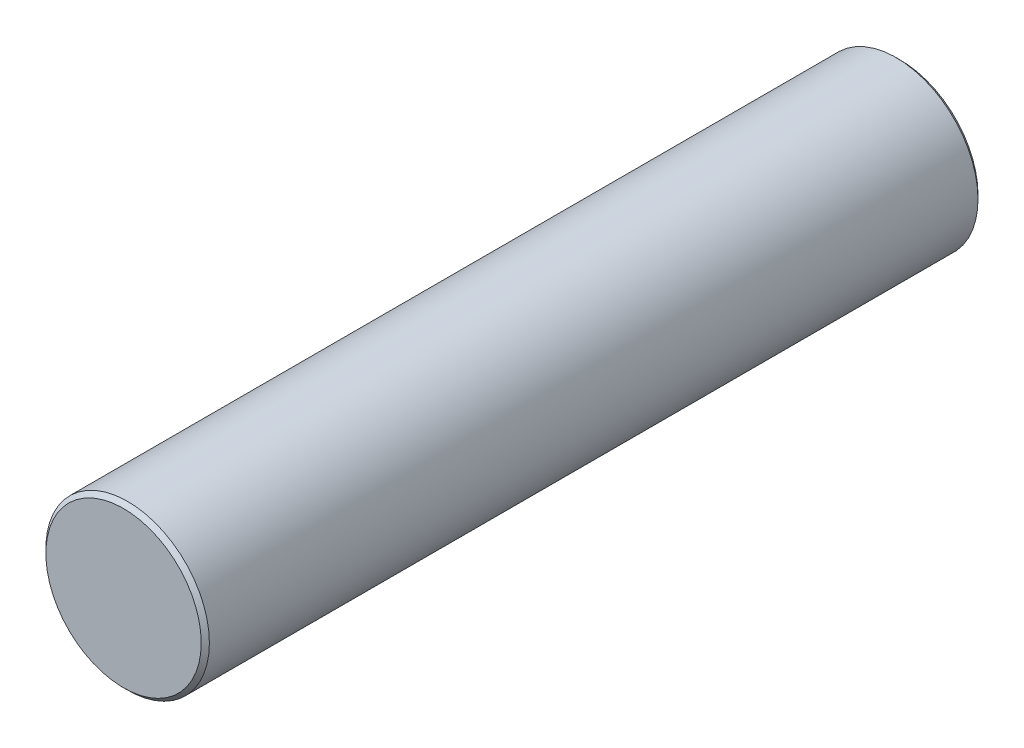
ISO-10303-21;
HEADER;
FILE_DESCRIPTION(('STEP AP214'),'2;1');
FILE_NAME('part.step','',(''),(''),'','','');
FILE_SCHEMA(('AUTOMOTIVE_DESIGN { 1 0 10303 214 1 1 1 1 }'));
ENDSEC;
DATA;
#1=APPLICATION_CONTEXT('core data for automotive mechanical design processes');
#2=APPLICATION_PROTOCOL_DEFINITION('international standard','automotive_design',2000,#1);
#3=PRODUCT_CONTEXT('',#1,'mechanical');
#4=PRODUCT('Part','Part','',(#3));
#5=PRODUCT_RELATED_PRODUCT_CATEGORY('part','',(#4));
#6=PRODUCT_DEFINITION_FORMATION('','',#4);
#7=PRODUCT_DEFINITION_CONTEXT('part definition',#1,'design');
#8=PRODUCT_DEFINITION('design','',#6,#7);
#9=PRODUCT_DEFINITION_SHAPE('','',#8);
#10=(LENGTH_UNIT() NAMED_UNIT(*) SI_UNIT(.MILLI.,.METRE.));
#11=(NAMED_UNIT(*) PLANE_ANGLE_UNIT() SI_UNIT($,.RADIAN.));
#12=(NAMED_UNIT(*) SI_UNIT($,.STERADIAN.) SOLID_ANGLE_UNIT());
#13=UNCERTAINTY_MEASURE_WITH_UNIT(LENGTH_MEASURE(1.E-05),#10,'distance_accuracy_value','');
#14=(GEOMETRIC_REPRESENTATION_CONTEXT(3) GLOBAL_UNCERTAINTY_ASSIGNED_CONTEXT((#13)) GLOBAL_UNIT_ASSIGNED_CONTEXT((#10,
#11,#12)) REPRESENTATION_CONTEXT('',''));
#15=CARTESIAN_POINT('',(0.,0.,0.));
#16=DIRECTION('',(0.,0.,1.));
#17=DIRECTION('',(1.,0.,0.));
#18=AXIS2_PLACEMENT_3D('',#15,#16,#17);
#19=CARTESIAN_POINT('',(0.,0.,190.));
#20=DIRECTION('',(0.,0.,-1.));
#21=DIRECTION('',(-1.,0.,0.));
#22=AXIS2_PLACEMENT_3D('',#19,#20,#21);
#23=CYLINDRICAL_SURFACE('',#22,20.);
#24=CARTESIAN_POINT('',(0.,0.,0.999999999999973));
#25=DIRECTION('',(0.,0.,1.));
#26=DIRECTION('',(1.,0.,0.));
#27=AXIS2_PLACEMENT_3D('',#24,#25,#26);
#28=CIRCLE('',#27,20.);
#29=CARTESIAN_POINT('',(20.,0.,0.999999999999973));
#30=VERTEX_POINT('',#29);
#31=EDGE_CURVE('E47',#30,#30,#28,.T.);
#32=ORIENTED_EDGE('',*,*,#31,.T.);
#33=EDGE_LOOP('',(#32));
#34=FACE_BOUND('',#33,.T.);
#35=CARTESIAN_POINT('',(0.,0.,189.));
#36=DIRECTION('',(0.,0.,1.));
#37=DIRECTION('',(1.,0.,0.));
#38=AXIS2_PLACEMENT_3D('',#35,#36,#37);
#39=CIRCLE('',#38,20.);
#40=CARTESIAN_POINT('',(20.,0.,189.));
#41=VERTEX_POINT('',#40);
#42=EDGE_CURVE('E51',#41,#41,#39,.F.);
#43=ORIENTED_EDGE('',*,*,#42,.T.);
#44=EDGE_LOOP('',(#43));
#45=FACE_BOUND('',#44,.T.);
#46=ADVANCED_FACE('F36',(#34,#45),#23,.T.);
#47=CARTESIAN_POINT('',(0.,0.,190.));
#48=DIRECTION('',(0.,0.,1.));
#49=DIRECTION('',(1.,0.,0.));
#50=AXIS2_PLACEMENT_3D('',#47,#48,#49);
#51=PLANE('',#50);
#52=CARTESIAN_POINT('',(0.,0.,190.));
#53=DIRECTION('',(0.,0.,1.));
#54=DIRECTION('',(1.,0.,0.));
#55=AXIS2_PLACEMENT_3D('',#52,#53,#54);
#56=CIRCLE('',#55,19.);
#57=CARTESIAN_POINT('',(19.,0.,190.));
#58=VERTEX_POINT('',#57);
#59=EDGE_CURVE('E10',#58,#58,#56,.T.);
#60=ORIENTED_EDGE('',*,*,#59,.T.);
#61=EDGE_LOOP('',(#60));
#62=FACE_BOUND('',#61,.T.);
#63=ADVANCED_FACE('F67',(#62),#51,.T.);
#64=CARTESIAN_POINT('',(0.,0.,0.));
#65=DIRECTION('',(0.,0.,1.));
#66=DIRECTION('',(1.,0.,0.));
#67=AXIS2_PLACEMENT_3D('',#64,#65,#66);
#68=PLANE('',#67);
#69=CARTESIAN_POINT('',(0.,0.,0.));
#70=DIRECTION('',(0.,0.,1.));
#71=DIRECTION('',(1.,0.,0.));
#72=AXIS2_PLACEMENT_3D('',#69,#70,#71);
#73=CIRCLE('',#72,19.);
#74=CARTESIAN_POINT('',(19.,0.,0.));
#75=VERTEX_POINT('',#74);
#76=EDGE_CURVE('E43',#75,#75,#73,.F.);
#77=ORIENTED_EDGE('',*,*,#76,.T.);
#78=EDGE_LOOP('',(#77));
#79=FACE_BOUND('',#78,.T.);
#80=ADVANCED_FACE('F64',(#79),#68,.F.);
#81=CARTESIAN_POINT('',(0.,0.,0.999999999999973));
#82=DIRECTION('',(0.,0.,1.));
#83=DIRECTION('',(1.,0.,0.));
#84=AXIS2_PLACEMENT_3D('',#81,#82,#83);
#85=CONICAL_SURFACE('',#84,20.,0.78539816339746);
#86=ORIENTED_EDGE('',*,*,#76,.F.);
#87=EDGE_LOOP('',(#86));
#88=FACE_BOUND('',#87,.T.);
#89=ORIENTED_EDGE('',*,*,#31,.F.);
#90=EDGE_LOOP('',(#89));
#91=FACE_BOUND('',#90,.T.);
#92=ADVANCED_FACE('F60',(#88,#91),#85,.T.);
#93=CARTESIAN_POINT('',(0.,0.,190.));
#94=DIRECTION('',(0.,0.,-1.));
#95=DIRECTION('',(-1.,0.,0.));
#96=AXIS2_PLACEMENT_3D('',#93,#94,#95);
#97=CONICAL_SURFACE('',#96,19.,0.785398163397454);
#98=ORIENTED_EDGE('',*,*,#42,.F.);
#99=EDGE_LOOP('',(#98));
#100=FACE_BOUND('',#99,.T.);
#101=ORIENTED_EDGE('',*,*,#59,.F.);
#102=EDGE_LOOP('',(#101));
#103=FACE_BOUND('',#102,.T.);
#104=ADVANCED_FACE('F38',(#100,#103),#97,.T.);
#105=CLOSED_SHELL('',(#46,#63,#80,#92,#104));
#106=MANIFOLD_SOLID_BREP('B2',#105);
#107=ADVANCED_BREP_SHAPE_REPRESENTATION('',(#18,#106),#14);
#108=SHAPE_DEFINITION_REPRESENTATION(#9,#107);
ENDSEC;
END-ISO-10303-21;
